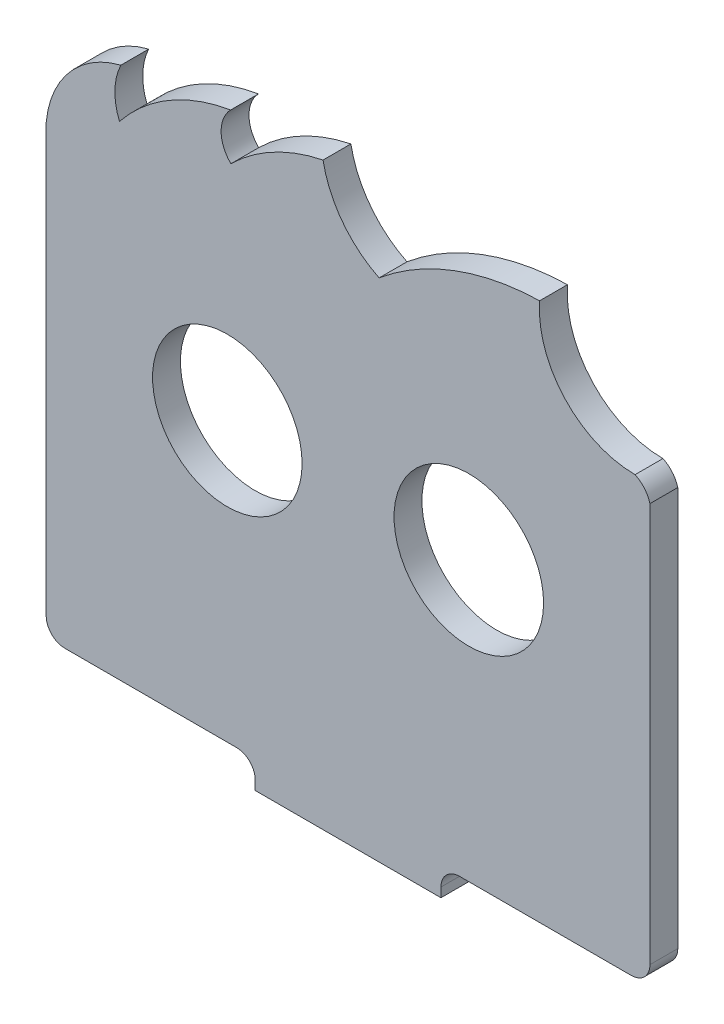
ISO-10303-21;
HEADER;
FILE_DESCRIPTION(('STEP AP214'),'2;1');
FILE_NAME('part.step','',(''),(''),'','','');
FILE_SCHEMA(('AUTOMOTIVE_DESIGN { 1 0 10303 214 1 1 1 1 }'));
ENDSEC;
DATA;
#1=APPLICATION_CONTEXT('core data for automotive mechanical design processes');
#2=APPLICATION_PROTOCOL_DEFINITION('international standard','automotive_design',2000,#1);
#3=PRODUCT_CONTEXT('',#1,'mechanical');
#4=PRODUCT('Part','Part','',(#3));
#5=PRODUCT_RELATED_PRODUCT_CATEGORY('part','',(#4));
#6=PRODUCT_DEFINITION_FORMATION('','',#4);
#7=PRODUCT_DEFINITION_CONTEXT('part definition',#1,'design');
#8=PRODUCT_DEFINITION('design','',#6,#7);
#9=PRODUCT_DEFINITION_SHAPE('','',#8);
#10=(LENGTH_UNIT() NAMED_UNIT(*) SI_UNIT(.MILLI.,.METRE.));
#11=(NAMED_UNIT(*) PLANE_ANGLE_UNIT() SI_UNIT($,.RADIAN.));
#12=(NAMED_UNIT(*) SI_UNIT($,.STERADIAN.) SOLID_ANGLE_UNIT());
#13=UNCERTAINTY_MEASURE_WITH_UNIT(LENGTH_MEASURE(1.E-05),#10,'distance_accuracy_value','');
#14=(GEOMETRIC_REPRESENTATION_CONTEXT(3) GLOBAL_UNCERTAINTY_ASSIGNED_CONTEXT((#13)) GLOBAL_UNIT_ASSIGNED_CONTEXT((#10,
#11,#12)) REPRESENTATION_CONTEXT('',''));
#15=CARTESIAN_POINT('',(0.,0.,0.));
#16=DIRECTION('',(0.,0.,1.));
#17=DIRECTION('',(1.,0.,0.));
#18=AXIS2_PLACEMENT_3D('',#15,#16,#17);
#19=CARTESIAN_POINT('',(-26.9388382551842,-8.04563346128009,-3.5));
#20=DIRECTION('',(0.,1.,0.));
#21=DIRECTION('',(0.,0.,1.));
#22=AXIS2_PLACEMENT_3D('',#19,#20,#21);
#23=CYLINDRICAL_SURFACE('',#22,1.5);
#24=CARTESIAN_POINT('',(-26.9388382551842,-8.04563346128009,-3.5));
#25=DIRECTION('',(0.,1.,0.));
#26=DIRECTION('',(0.,0.,-1.));
#27=AXIS2_PLACEMENT_3D('',#24,#25,#26);
#28=CIRCLE('',#27,1.5);
#29=CARTESIAN_POINT('',(-26.9388382551842,-8.04563346128009,-5.));
#30=VERTEX_POINT('',#29);
#31=EDGE_CURVE('E338',#30,#30,#28,.T.);
#32=ORIENTED_EDGE('',*,*,#31,.F.);
#33=EDGE_LOOP('',(#32));
#34=FACE_BOUND('',#33,.T.);
#35=CARTESIAN_POINT('',(-26.9388382551842,-6.04563346128009,-3.5));
#36=DIRECTION('',(0.,1.,0.));
#37=DIRECTION('',(0.,0.,1.));
#38=AXIS2_PLACEMENT_3D('',#35,#36,#37);
#39=CIRCLE('',#38,1.5);
#40=CARTESIAN_POINT('',(-26.9388382551842,-6.04563346128009,-2.));
#41=VERTEX_POINT('',#40);
#42=EDGE_CURVE('E37',#41,#41,#39,.F.);
#43=ORIENTED_EDGE('',*,*,#42,.F.);
#44=EDGE_LOOP('',(#43));
#45=FACE_BOUND('',#44,.T.);
#46=ADVANCED_FACE('F33',(#34,#45),#23,.F.);
#47=CARTESIAN_POINT('',(-14.9388382551842,-8.04563346128009,-3.5));
#48=DIRECTION('',(0.,1.,0.));
#49=DIRECTION('',(0.,0.,1.));
#50=AXIS2_PLACEMENT_3D('',#47,#48,#49);
#51=CYLINDRICAL_SURFACE('',#50,1.5);
#52=CARTESIAN_POINT('',(-14.9388382551842,-8.04563346128009,-3.5));
#53=DIRECTION('',(0.,1.,0.));
#54=DIRECTION('',(0.,0.,1.));
#55=AXIS2_PLACEMENT_3D('',#52,#53,#54);
#56=CIRCLE('',#55,1.5);
#57=CARTESIAN_POINT('',(-14.9388382551842,-8.04563346128009,-2.));
#58=VERTEX_POINT('',#57);
#59=EDGE_CURVE('E353',#58,#58,#56,.T.);
#60=ORIENTED_EDGE('',*,*,#59,.F.);
#61=EDGE_LOOP('',(#60));
#62=FACE_BOUND('',#61,.T.);
#63=CARTESIAN_POINT('',(-14.9388382551842,-6.04563346128009,-3.5));
#64=DIRECTION('',(0.,1.,0.));
#65=DIRECTION('',(0.,0.,1.));
#66=AXIS2_PLACEMENT_3D('',#63,#64,#65);
#67=CIRCLE('',#66,1.5);
#68=CARTESIAN_POINT('',(-14.9388382551842,-6.04563346128009,-2.));
#69=VERTEX_POINT('',#68);
#70=EDGE_CURVE('E332',#69,#69,#67,.F.);
#71=ORIENTED_EDGE('',*,*,#70,.F.);
#72=EDGE_LOOP('',(#71));
#73=FACE_BOUND('',#72,.T.);
#74=ADVANCED_FACE('F520',(#62,#73),#51,.F.);
#75=CARTESIAN_POINT('',(-32.9388382551842,-7.04419571135436,3.));
#76=DIRECTION('',(0.,0.,1.));
#77=DIRECTION('',(1.,0.,0.));
#78=AXIS2_PLACEMENT_3D('',#75,#76,#77);
#79=PLANE('',#78);
#80=CARTESIAN_POINT('',(-32.9388382551842,-7.04419571135436,3.));
#81=DIRECTION('',(0.,0.,-1.));
#82=DIRECTION('',(1.,0.,0.));
#83=AXIS2_PLACEMENT_3D('',#80,#81,#82);
#84=CIRCLE('',#83,2.);
#85=CARTESIAN_POINT('',(-32.9373999884774,-5.04419622850721,3.));
#86=VERTEX_POINT('',#85);
#87=CARTESIAN_POINT('',(-30.9388382551842,-7.04419571135437,3.));
#88=VERTEX_POINT('',#87);
#89=EDGE_CURVE('E264',#86,#88,#84,.T.);
#90=ORIENTED_EDGE('',*,*,#89,.T.);
#91=DIRECTION('',(0.,-1.,0.));
#92=VECTOR('',#91,1.);
#93=CARTESIAN_POINT('',(-30.9388382551842,-8.04563346128009,3.));
#94=LINE('',#93,#92);
#95=CARTESIAN_POINT('',(-30.9388382551842,-8.04563346128009,3.));
#96=VERTEX_POINT('',#95);
#97=EDGE_CURVE('E379',#88,#96,#94,.T.);
#98=ORIENTED_EDGE('',*,*,#97,.T.);
#99=DIRECTION('',(1.,0.,0.));
#100=VECTOR('',#99,1.);
#101=CARTESIAN_POINT('',(-30.9388382551842,-8.04563346128009,3.));
#102=LINE('',#101,#100);
#103=CARTESIAN_POINT('',(-10.9388382551842,-8.04563346128008,3.));
#104=VERTEX_POINT('',#103);
#105=EDGE_CURVE('E381',#96,#104,#102,.T.);
#106=ORIENTED_EDGE('',*,*,#105,.T.);
#107=DIRECTION('',(0.,1.,0.));
#108=VECTOR('',#107,1.);
#109=CARTESIAN_POINT('',(-10.9388382551842,-8.04563346128008,3.));
#110=LINE('',#109,#108);
#111=CARTESIAN_POINT('',(-10.9388382551842,-7.04563346128011,3.));
#112=VERTEX_POINT('',#111);
#113=EDGE_CURVE('E383',#104,#112,#110,.T.);
#114=ORIENTED_EDGE('',*,*,#113,.T.);
#115=CARTESIAN_POINT('',(-8.9388382551842,-7.04563346128009,3.));
#116=DIRECTION('',(0.,0.,-1.));
#117=DIRECTION('',(-1.,0.,0.));
#118=AXIS2_PLACEMENT_3D('',#115,#116,#117);
#119=CIRCLE('',#118,2.);
#120=CARTESIAN_POINT('',(-8.93883825518419,-5.04563346128009,3.));
#121=VERTEX_POINT('',#120);
#122=EDGE_CURVE('E219',#112,#121,#119,.T.);
#123=ORIENTED_EDGE('',*,*,#122,.T.);
#124=DIRECTION('',(1.,0.,0.));
#125=VECTOR('',#124,1.);
#126=CARTESIAN_POINT('',(9.54977879721579,-5.04563346128009,3.));
#127=LINE('',#126,#125);
#128=CARTESIAN_POINT('',(9.54977879721579,-5.04563346128009,3.));
#129=VERTEX_POINT('',#128);
#130=EDGE_CURVE('E386',#121,#129,#127,.T.);
#131=ORIENTED_EDGE('',*,*,#130,.T.);
#132=CARTESIAN_POINT('',(9.54977879715963,-3.03425009342392,3.));
#133=DIRECTION('',(0.,0.,1.));
#134=DIRECTION('',(1.,0.,0.));
#135=AXIS2_PLACEMENT_3D('',#132,#133,#134);
#136=CIRCLE('',#135,2.01138336785617);
#137=CARTESIAN_POINT('',(11.5611621650158,-3.03425009338009,3.));
#138=VERTEX_POINT('',#137);
#139=EDGE_CURVE('E388',#129,#138,#136,.T.);
#140=ORIENTED_EDGE('',*,*,#139,.T.);
#141=DIRECTION('',(0.,1.,0.));
#142=VECTOR('',#141,1.);
#143=CARTESIAN_POINT('',(11.5611621650158,-3.03425009338009,3.));
#144=LINE('',#143,#142);
#145=CARTESIAN_POINT('',(11.5611621650158,39.9543665387199,3.));
#146=VERTEX_POINT('',#145);
#147=EDGE_CURVE('E390',#138,#146,#144,.T.);
#148=ORIENTED_EDGE('',*,*,#147,.T.);
#149=CARTESIAN_POINT('',(8.6711571271316,39.1494622706601,3.));
#150=DIRECTION('',(0.,0.,1.));
#151=DIRECTION('',(1.,0.,0.));
#152=AXIS2_PLACEMENT_3D('',#149,#150,#151);
#153=CIRCLE('',#152,2.99999999995616);
#154=CARTESIAN_POINT('',(9.96326877626826,41.8569421848796,3.));
#155=VERTEX_POINT('',#154);
#156=EDGE_CURVE('E392',#146,#155,#153,.T.);
#157=ORIENTED_EDGE('',*,*,#156,.T.);
#158=CARTESIAN_POINT('',(9.96327365671662,52.164706248931,3.));
#159=DIRECTION('',(0.,0.,-1.));
#160=DIRECTION('',(1.,0.,0.));
#161=AXIS2_PLACEMENT_3D('',#158,#159,#160);
#162=CIRCLE('',#161,10.3077640640525);
#163=CARTESIAN_POINT('',(-0.316073105073237,52.9295788860759,3.));
#164=VERTEX_POINT('',#163);
#165=EDGE_CURVE('E394',#155,#164,#162,.T.);
#166=ORIENTED_EDGE('',*,*,#165,.T.);
#167=CARTESIAN_POINT('',(0.334070879254689,25.0061800654525,3.));
#168=DIRECTION('',(0.,0.,1.));
#169=DIRECTION('',(1.,0.,0.));
#170=AXIS2_PLACEMENT_3D('',#167,#168,#169);
#171=CIRCLE('',#170,27.9309664869649);
#172=CARTESIAN_POINT('',(-17.5966330199045,46.4217992854664,3.));
#173=VERTEX_POINT('',#172);
#174=EDGE_CURVE('E396',#164,#173,#171,.T.);
#175=ORIENTED_EDGE('',*,*,#174,.T.);
#176=CARTESIAN_POINT('',(-12.6427939069682,56.4447468580342,3.));
#177=DIRECTION('',(0.,0.,-1.));
#178=DIRECTION('',(1.,0.,0.));
#179=AXIS2_PLACEMENT_3D('',#176,#177,#178);
#180=CIRCLE('',#179,11.1803398874677);
#181=CARTESIAN_POINT('',(-23.6334554327833,54.3940496048375,3.));
#182=VERTEX_POINT('',#181);
#183=EDGE_CURVE('E398',#173,#182,#180,.T.);
#184=ORIENTED_EDGE('',*,*,#183,.T.);
#185=CARTESIAN_POINT('',(-19.6409106266977,34.9994260531066,3.));
#186=DIRECTION('',(0.,0.,1.));
#187=DIRECTION('',(1.,0.,0.));
#188=AXIS2_PLACEMENT_3D('',#185,#186,#187);
#189=CIRCLE('',#188,19.8013089653679);
#190=CARTESIAN_POINT('',(-33.5590096383543,49.0841112339575,3.));
#191=VERTEX_POINT('',#190);
#192=EDGE_CURVE('E400',#182,#191,#189,.T.);
#193=ORIENTED_EDGE('',*,*,#192,.T.);
#194=CARTESIAN_POINT('',(-31.0705631471978,51.5956115945062,3.));
#195=DIRECTION('',(0.,0.,-1.));
#196=DIRECTION('',(1.,0.,0.));
#197=AXIS2_PLACEMENT_3D('',#194,#195,#196);
#198=CIRCLE('',#197,3.53553390598723);
#199=CARTESIAN_POINT('',(-33.5820635077474,54.0840580856617,3.));
#200=VERTEX_POINT('',#199);
#201=EDGE_CURVE('E402',#191,#200,#198,.T.);
#202=ORIENTED_EDGE('',*,*,#201,.T.);
#203=CARTESIAN_POINT('',(-30.3940306785091,34.9985545114886,3.));
#204=DIRECTION('',(0.,0.,1.));
#205=DIRECTION('',(1.,0.,0.));
#206=AXIS2_PLACEMENT_3D('',#203,#204,#205);
#207=CIRCLE('',#206,19.349935400411);
#208=CARTESIAN_POINT('',(-45.5496605344325,47.0288032067699,3.));
#209=VERTEX_POINT('',#208);
#210=EDGE_CURVE('E404',#200,#209,#207,.T.);
#211=ORIENTED_EDGE('',*,*,#210,.T.);
#212=CARTESIAN_POINT('',(-39.5276442918751,49.5258655556389,3.));
#213=DIRECTION('',(0.,0.,-1.));
#214=DIRECTION('',(1.,0.,0.));
#215=AXIS2_PLACEMENT_3D('',#212,#213,#214);
#216=CIRCLE('',#215,6.51920240518462);
#217=CARTESIAN_POINT('',(-45.4026362473856,52.351545920162,3.));
#218=VERTEX_POINT('',#217);
#219=EDGE_CURVE('E406',#209,#218,#216,.T.);
#220=ORIENTED_EDGE('',*,*,#219,.T.);
#221=CARTESIAN_POINT('',(-42.8405498499119,42.0197772486442,3.));
#222=DIRECTION('',(0.,0.,1.));
#223=DIRECTION('',(1.,0.,0.));
#224=AXIS2_PLACEMENT_3D('',#221,#222,#223);
#225=CIRCLE('',#224,10.6447043448786);
#226=CARTESIAN_POINT('',(-53.4388382551842,43.0127593575199,3.));
#227=VERTEX_POINT('',#226);
#228=EDGE_CURVE('E408',#218,#227,#225,.T.);
#229=ORIENTED_EDGE('',*,*,#228,.T.);
#230=DIRECTION('',(0.,-1.,0.));
#231=VECTOR('',#230,1.);
#232=CARTESIAN_POINT('',(-53.4388382551842,43.0127593575199,3.));
#233=LINE('',#232,#231);
#234=CARTESIAN_POINT('',(-53.4388382551842,-2.98832438728009,3.));
#235=VERTEX_POINT('',#234);
#236=EDGE_CURVE('E410',#227,#235,#233,.T.);
#237=ORIENTED_EDGE('',*,*,#236,.T.);
#238=CARTESIAN_POINT('',(-51.4276967484391,-3.01951560936317,3.));
#239=DIRECTION('',(0.,0.,1.));
#240=DIRECTION('',(1.,0.,0.));
#241=AXIS2_PLACEMENT_3D('',#238,#239,#240);
#242=CIRCLE('',#241,2.01138336785609);
#243=CARTESIAN_POINT('',(-51.4301685763842,-5.03089745838009,3.));
#244=VERTEX_POINT('',#243);
#245=EDGE_CURVE('E412',#235,#244,#242,.T.);
#246=ORIENTED_EDGE('',*,*,#245,.T.);
#247=DIRECTION('',(0.999999741423577,-0.000719133353405182,0.));
#248=VECTOR('',#247,1.);
#249=CARTESIAN_POINT('',(-32.9373999884774,-5.04419622850721,3.));
#250=LINE('',#249,#248);
#251=EDGE_CURVE('E269',#244,#86,#250,.T.);
#252=ORIENTED_EDGE('',*,*,#251,.T.);
#253=EDGE_LOOP('',(#90,#98,#106,#114,#123,#131,#140,#148,#157,#166,#175,#184,#193,#202,#211,
#220,#229,#237,#246,#252));
#254=FACE_BOUND('',#253,.T.);
#255=CARTESIAN_POINT('',(-7.93883825518421,24.9543665387199,3.));
#256=DIRECTION('',(0.,0.,1.));
#257=DIRECTION('',(1.,0.,0.));
#258=AXIS2_PLACEMENT_3D('',#255,#256,#257);
#259=CIRCLE('',#258,8.05000000000001);
#260=CARTESIAN_POINT('',(0.111161744815805,24.9543665387199,3.));
#261=VERTEX_POINT('',#260);
#262=EDGE_CURVE('E233',#261,#261,#259,.T.);
#263=ORIENTED_EDGE('',*,*,#262,.F.);
#264=EDGE_LOOP('',(#263));
#265=FACE_BOUND('',#264,.T.);
#266=CARTESIAN_POINT('',(-33.9388382551842,24.9543665387199,3.));
#267=DIRECTION('',(0.,0.,1.));
#268=DIRECTION('',(1.,0.,0.));
#269=AXIS2_PLACEMENT_3D('',#266,#267,#268);
#270=CIRCLE('',#269,8.05);
#271=CARTESIAN_POINT('',(-25.8888382551842,24.9543665387199,3.));
#272=VERTEX_POINT('',#271);
#273=EDGE_CURVE('E367',#272,#272,#270,.T.);
#274=ORIENTED_EDGE('',*,*,#273,.F.);
#275=EDGE_LOOP('',(#274));
#276=FACE_BOUND('',#275,.T.);
#277=ADVANCED_FACE('F416',(#254,#265,#276),#79,.T.);
#278=CARTESIAN_POINT('',(-32.9388382551842,-7.04419571135436,0.));
#279=DIRECTION('',(0.,0.,1.));
#280=DIRECTION('',(1.,0.,0.));
#281=AXIS2_PLACEMENT_3D('',#278,#279,#280);
#282=PLANE('',#281);
#283=DIRECTION('',(-1.,0.,0.));
#284=VECTOR('',#283,1.);
#285=CARTESIAN_POINT('',(-32.9388382551842,-5.04563346128009,0.));
#286=LINE('',#285,#284);
#287=CARTESIAN_POINT('',(-10.9388382551842,-5.04563346128009,0.));
#288=VERTEX_POINT('',#287);
#289=CARTESIAN_POINT('',(-30.9388382551842,-5.04563346128009,0.));
#290=VERTEX_POINT('',#289);
#291=EDGE_CURVE('E319',#288,#290,#286,.T.);
#292=ORIENTED_EDGE('',*,*,#291,.T.);
#293=DIRECTION('',(0.,-1.,0.));
#294=VECTOR('',#293,1.);
#295=CARTESIAN_POINT('',(-30.9388382551842,-7.04419571135436,0.));
#296=LINE('',#295,#294);
#297=CARTESIAN_POINT('',(-30.9388382551842,-7.04419571135436,0.));
#298=VERTEX_POINT('',#297);
#299=EDGE_CURVE('E211',#290,#298,#296,.T.);
#300=ORIENTED_EDGE('',*,*,#299,.T.);
#301=CARTESIAN_POINT('',(-32.9388382551842,-7.04419571135436,0.));
#302=DIRECTION('',(0.,0.,-1.));
#303=DIRECTION('',(1.,0.,0.));
#304=AXIS2_PLACEMENT_3D('',#301,#302,#303);
#305=CIRCLE('',#304,2.);
#306=CARTESIAN_POINT('',(-32.9373999884774,-5.04419622850721,0.));
#307=VERTEX_POINT('',#306);
#308=EDGE_CURVE('E228',#307,#298,#305,.T.);
#309=ORIENTED_EDGE('',*,*,#308,.F.);
#310=DIRECTION('',(0.999999741423577,-0.000719133353405182,0.));
#311=VECTOR('',#310,1.);
#312=CARTESIAN_POINT('',(-32.9373999884774,-5.04419622850721,0.));
#313=LINE('',#312,#311);
#314=CARTESIAN_POINT('',(-51.4301685763842,-5.03089745838009,0.));
#315=VERTEX_POINT('',#314);
#316=EDGE_CURVE('E262',#315,#307,#313,.T.);
#317=ORIENTED_EDGE('',*,*,#316,.F.);
#318=CARTESIAN_POINT('',(-51.4276967484391,-3.01951560936317,0.));
#319=DIRECTION('',(0.,0.,1.));
#320=DIRECTION('',(1.,0.,0.));
#321=AXIS2_PLACEMENT_3D('',#318,#319,#320);
#322=CIRCLE('',#321,2.01138336785609);
#323=CARTESIAN_POINT('',(-53.4388382551842,-2.98832438728009,0.));
#324=VERTEX_POINT('',#323);
#325=EDGE_CURVE('E260',#324,#315,#322,.T.);
#326=ORIENTED_EDGE('',*,*,#325,.F.);
#327=DIRECTION('',(0.,-1.,0.));
#328=VECTOR('',#327,1.);
#329=CARTESIAN_POINT('',(-53.4388382551842,43.0127593575199,0.));
#330=LINE('',#329,#328);
#331=CARTESIAN_POINT('',(-53.4388382551842,43.0127593575199,0.));
#332=VERTEX_POINT('',#331);
#333=EDGE_CURVE('E258',#332,#324,#330,.T.);
#334=ORIENTED_EDGE('',*,*,#333,.F.);
#335=CARTESIAN_POINT('',(-42.8405498499119,42.0197772486442,0.));
#336=DIRECTION('',(0.,0.,1.));
#337=DIRECTION('',(1.,0.,0.));
#338=AXIS2_PLACEMENT_3D('',#335,#336,#337);
#339=CIRCLE('',#338,10.6447043448786);
#340=CARTESIAN_POINT('',(-45.4026362473856,52.351545920162,0.));
#341=VERTEX_POINT('',#340);
#342=EDGE_CURVE('E256',#341,#332,#339,.T.);
#343=ORIENTED_EDGE('',*,*,#342,.F.);
#344=CARTESIAN_POINT('',(-39.5276442918751,49.5258655556389,0.));
#345=DIRECTION('',(0.,0.,-1.));
#346=DIRECTION('',(1.,0.,0.));
#347=AXIS2_PLACEMENT_3D('',#344,#345,#346);
#348=CIRCLE('',#347,6.51920240518462);
#349=CARTESIAN_POINT('',(-45.5496605344325,47.0288032067699,0.));
#350=VERTEX_POINT('',#349);
#351=EDGE_CURVE('E254',#350,#341,#348,.T.);
#352=ORIENTED_EDGE('',*,*,#351,.F.);
#353=CARTESIAN_POINT('',(-30.3940306785091,34.9985545114886,0.));
#354=DIRECTION('',(0.,0.,1.));
#355=DIRECTION('',(1.,0.,0.));
#356=AXIS2_PLACEMENT_3D('',#353,#354,#355);
#357=CIRCLE('',#356,19.349935400411);
#358=CARTESIAN_POINT('',(-33.5820635077474,54.0840580856617,0.));
#359=VERTEX_POINT('',#358);
#360=EDGE_CURVE('E252',#359,#350,#357,.T.);
#361=ORIENTED_EDGE('',*,*,#360,.F.);
#362=CARTESIAN_POINT('',(-31.0705631471978,51.5956115945062,0.));
#363=DIRECTION('',(0.,0.,-1.));
#364=DIRECTION('',(1.,0.,0.));
#365=AXIS2_PLACEMENT_3D('',#362,#363,#364);
#366=CIRCLE('',#365,3.53553390598723);
#367=CARTESIAN_POINT('',(-33.5590096383543,49.0841112339575,0.));
#368=VERTEX_POINT('',#367);
#369=EDGE_CURVE('E250',#368,#359,#366,.T.);
#370=ORIENTED_EDGE('',*,*,#369,.F.);
#371=CARTESIAN_POINT('',(-19.6409106266977,34.9994260531066,0.));
#372=DIRECTION('',(0.,0.,1.));
#373=DIRECTION('',(1.,0.,0.));
#374=AXIS2_PLACEMENT_3D('',#371,#372,#373);
#375=CIRCLE('',#374,19.8013089653679);
#376=CARTESIAN_POINT('',(-23.6334554327833,54.3940496048375,0.));
#377=VERTEX_POINT('',#376);
#378=EDGE_CURVE('E248',#377,#368,#375,.T.);
#379=ORIENTED_EDGE('',*,*,#378,.F.);
#380=CARTESIAN_POINT('',(-12.6427939069682,56.4447468580342,0.));
#381=DIRECTION('',(0.,0.,-1.));
#382=DIRECTION('',(1.,0.,0.));
#383=AXIS2_PLACEMENT_3D('',#380,#381,#382);
#384=CIRCLE('',#383,11.1803398874677);
#385=CARTESIAN_POINT('',(-17.5966330199045,46.4217992854664,0.));
#386=VERTEX_POINT('',#385);
#387=EDGE_CURVE('E246',#386,#377,#384,.T.);
#388=ORIENTED_EDGE('',*,*,#387,.F.);
#389=CARTESIAN_POINT('',(0.334070879254689,25.0061800654525,0.));
#390=DIRECTION('',(0.,0.,1.));
#391=DIRECTION('',(1.,0.,0.));
#392=AXIS2_PLACEMENT_3D('',#389,#390,#391);
#393=CIRCLE('',#392,27.9309664869649);
#394=CARTESIAN_POINT('',(-0.316073105073237,52.9295788860759,0.));
#395=VERTEX_POINT('',#394);
#396=EDGE_CURVE('E244',#395,#386,#393,.T.);
#397=ORIENTED_EDGE('',*,*,#396,.F.);
#398=CARTESIAN_POINT('',(9.96327365671662,52.164706248931,0.));
#399=DIRECTION('',(0.,0.,-1.));
#400=DIRECTION('',(1.,0.,0.));
#401=AXIS2_PLACEMENT_3D('',#398,#399,#400);
#402=CIRCLE('',#401,10.3077640640525);
#403=CARTESIAN_POINT('',(9.96326877626826,41.8569421848796,0.));
#404=VERTEX_POINT('',#403);
#405=EDGE_CURVE('E242',#404,#395,#402,.T.);
#406=ORIENTED_EDGE('',*,*,#405,.F.);
#407=CARTESIAN_POINT('',(8.6711571271316,39.1494622706601,0.));
#408=DIRECTION('',(0.,0.,1.));
#409=DIRECTION('',(1.,0.,0.));
#410=AXIS2_PLACEMENT_3D('',#407,#408,#409);
#411=CIRCLE('',#410,2.99999999995616);
#412=CARTESIAN_POINT('',(11.5611621650158,39.9543665387199,0.));
#413=VERTEX_POINT('',#412);
#414=EDGE_CURVE('E240',#413,#404,#411,.T.);
#415=ORIENTED_EDGE('',*,*,#414,.F.);
#416=DIRECTION('',(0.,1.,0.));
#417=VECTOR('',#416,1.);
#418=CARTESIAN_POINT('',(11.5611621650158,-3.03425009338009,0.));
#419=LINE('',#418,#417);
#420=CARTESIAN_POINT('',(11.5611621650158,-3.03425009338009,0.));
#421=VERTEX_POINT('',#420);
#422=EDGE_CURVE('E238',#421,#413,#419,.T.);
#423=ORIENTED_EDGE('',*,*,#422,.F.);
#424=CARTESIAN_POINT('',(9.54977879715963,-3.03425009342392,0.));
#425=DIRECTION('',(0.,0.,1.));
#426=DIRECTION('',(1.,0.,0.));
#427=AXIS2_PLACEMENT_3D('',#424,#425,#426);
#428=CIRCLE('',#427,2.01138336785617);
#429=CARTESIAN_POINT('',(9.54977879721579,-5.04563346128009,0.));
#430=VERTEX_POINT('',#429);
#431=EDGE_CURVE('E230',#430,#421,#428,.T.);
#432=ORIENTED_EDGE('',*,*,#431,.F.);
#433=DIRECTION('',(1.,0.,0.));
#434=VECTOR('',#433,1.);
#435=CARTESIAN_POINT('',(9.54977879721579,-5.04563346128009,0.));
#436=LINE('',#435,#434);
#437=CARTESIAN_POINT('',(-8.93883825518419,-5.04563346128009,0.));
#438=VERTEX_POINT('',#437);
#439=EDGE_CURVE('E227',#438,#430,#436,.T.);
#440=ORIENTED_EDGE('',*,*,#439,.F.);
#441=CARTESIAN_POINT('',(-8.9388382551842,-7.04563346128009,0.));
#442=DIRECTION('',(0.,0.,-1.));
#443=DIRECTION('',(-1.,0.,0.));
#444=AXIS2_PLACEMENT_3D('',#441,#442,#443);
#445=CIRCLE('',#444,2.);
#446=CARTESIAN_POINT('',(-10.9388382551842,-7.04563346128009,0.));
#447=VERTEX_POINT('',#446);
#448=EDGE_CURVE('E217',#447,#438,#445,.T.);
#449=ORIENTED_EDGE('',*,*,#448,.F.);
#450=DIRECTION('',(0.,1.,0.));
#451=VECTOR('',#450,1.);
#452=CARTESIAN_POINT('',(-10.9388382551842,-7.04419571135436,0.));
#453=LINE('',#452,#451);
#454=EDGE_CURVE('E198',#447,#288,#453,.T.);
#455=ORIENTED_EDGE('',*,*,#454,.T.);
#456=EDGE_LOOP('',(#292,#300,#309,#317,#326,#334,#343,#352,#361,#370,#379,#388,#397,#406,#415,
#423,#432,#440,#449,#455));
#457=FACE_BOUND('',#456,.T.);
#458=CARTESIAN_POINT('',(-7.93883825518421,24.9543665387199,0.));
#459=DIRECTION('',(0.,0.,1.));
#460=DIRECTION('',(1.,0.,0.));
#461=AXIS2_PLACEMENT_3D('',#458,#459,#460);
#462=CIRCLE('',#461,8.05000000000001);
#463=CARTESIAN_POINT('',(0.111161744815805,24.9543665387199,0.));
#464=VERTEX_POINT('',#463);
#465=EDGE_CURVE('E370',#464,#464,#462,.T.);
#466=ORIENTED_EDGE('',*,*,#465,.T.);
#467=EDGE_LOOP('',(#466));
#468=FACE_BOUND('',#467,.T.);
#469=CARTESIAN_POINT('',(-33.9388382551842,24.9543665387199,0.));
#470=DIRECTION('',(0.,0.,1.));
#471=DIRECTION('',(1.,0.,0.));
#472=AXIS2_PLACEMENT_3D('',#469,#470,#471);
#473=CIRCLE('',#472,8.05);
#474=CARTESIAN_POINT('',(-25.8888382551842,24.9543665387199,0.));
#475=VERTEX_POINT('',#474);
#476=EDGE_CURVE('E366',#475,#475,#473,.T.);
#477=ORIENTED_EDGE('',*,*,#476,.T.);
#478=EDGE_LOOP('',(#477));
#479=FACE_BOUND('',#478,.T.);
#480=ADVANCED_FACE('F224',(#457,#468,#479),#282,.F.);
#481=CARTESIAN_POINT('',(-32.9388382551842,-7.04419571135436,3.));
#482=DIRECTION('',(0.,0.,-1.));
#483=DIRECTION('',(-1.,0.,0.));
#484=AXIS2_PLACEMENT_3D('',#481,#482,#483);
#485=CYLINDRICAL_SURFACE('',#484,2.);
#486=ORIENTED_EDGE('',*,*,#308,.T.);
#487=DIRECTION('',(0.,0.,-1.));
#488=VECTOR('',#487,1.);
#489=CARTESIAN_POINT('',(-30.9388382551842,-7.04419571135437,3.));
#490=LINE('',#489,#488);
#491=EDGE_CURVE('E316',#88,#298,#490,.T.);
#492=ORIENTED_EDGE('',*,*,#491,.F.);
#493=ORIENTED_EDGE('',*,*,#89,.F.);
#494=DIRECTION('',(0.,0.,-1.));
#495=VECTOR('',#494,1.);
#496=CARTESIAN_POINT('',(-32.9373999884774,-5.04419622850721,3.));
#497=LINE('',#496,#495);
#498=EDGE_CURVE('E265',#86,#307,#497,.T.);
#499=ORIENTED_EDGE('',*,*,#498,.T.);
#500=EDGE_LOOP('',(#486,#492,#493,#499));
#501=FACE_BOUND('',#500,.T.);
#502=ADVANCED_FACE('F427',(#501),#485,.F.);
#503=CARTESIAN_POINT('',(-30.9388382551842,-8.04563346128009,3.));
#504=DIRECTION('',(1.,0.,0.));
#505=DIRECTION('',(0.,0.,-1.));
#506=AXIS2_PLACEMENT_3D('',#503,#504,#505);
#507=PLANE('',#506);
#508=DIRECTION('',(0.,0.,1.));
#509=VECTOR('',#508,1.);
#510=CARTESIAN_POINT('',(-30.9388382551842,-5.04563346128009,-8.));
#511=LINE('',#510,#509);
#512=CARTESIAN_POINT('',(-30.9388382551842,-5.04563346128009,-6.));
#513=VERTEX_POINT('',#512);
#514=EDGE_CURVE('E212',#513,#290,#511,.T.);
#515=ORIENTED_EDGE('',*,*,#514,.F.);
#516=DIRECTION('',(0.,-1.,0.));
#517=VECTOR('',#516,1.);
#518=CARTESIAN_POINT('',(-30.9388382551842,-8.04563346128009,-6.));
#519=LINE('',#518,#517);
#520=CARTESIAN_POINT('',(-30.9388382551842,-8.04563346128009,-6.));
#521=VERTEX_POINT('',#520);
#522=EDGE_CURVE('E321',#513,#521,#519,.T.);
#523=ORIENTED_EDGE('',*,*,#522,.T.);
#524=DIRECTION('',(0.,0.,-1.));
#525=VECTOR('',#524,1.);
#526=CARTESIAN_POINT('',(-30.9388382551842,-8.04563346128009,3.));
#527=LINE('',#526,#525);
#528=EDGE_CURVE('E313',#96,#521,#527,.T.);
#529=ORIENTED_EDGE('',*,*,#528,.F.);
#530=ORIENTED_EDGE('',*,*,#97,.F.);
#531=ORIENTED_EDGE('',*,*,#491,.T.);
#532=ORIENTED_EDGE('',*,*,#299,.F.);
#533=EDGE_LOOP('',(#515,#523,#529,#530,#531,#532));
#534=FACE_BOUND('',#533,.T.);
#535=ADVANCED_FACE('F431',(#534),#507,.F.);
#536=CARTESIAN_POINT('',(-30.9388382551842,-8.04563346128009,3.));
#537=DIRECTION('',(0.,1.,0.));
#538=DIRECTION('',(-1.,0.,0.));
#539=AXIS2_PLACEMENT_3D('',#536,#537,#538);
#540=PLANE('',#539);
#541=ORIENTED_EDGE('',*,*,#59,.T.);
#542=EDGE_LOOP('',(#541));
#543=FACE_BOUND('',#542,.T.);
#544=ORIENTED_EDGE('',*,*,#31,.T.);
#545=EDGE_LOOP('',(#544));
#546=FACE_BOUND('',#545,.T.);
#547=ORIENTED_EDGE('',*,*,#528,.T.);
#548=CARTESIAN_POINT('',(-28.9388382551842,-8.04563346128009,-6.));
#549=DIRECTION('',(0.,1.,0.));
#550=DIRECTION('',(-1.,0.,0.));
#551=AXIS2_PLACEMENT_3D('',#548,#549,#550);
#552=CIRCLE('',#551,2.);
#553=CARTESIAN_POINT('',(-28.9388382551842,-8.04563346128009,-8.));
#554=VERTEX_POINT('',#553);
#555=EDGE_CURVE('E326',#521,#554,#552,.F.);
#556=ORIENTED_EDGE('',*,*,#555,.T.);
#557=DIRECTION('',(1.,0.,0.));
#558=VECTOR('',#557,1.);
#559=CARTESIAN_POINT('',(-10.9388382551842,-8.04563346128009,-8.));
#560=LINE('',#559,#558);
#561=CARTESIAN_POINT('',(-12.9388382551842,-8.04563346128009,-8.));
#562=VERTEX_POINT('',#561);
#563=EDGE_CURVE('E356',#554,#562,#560,.T.);
#564=ORIENTED_EDGE('',*,*,#563,.T.);
#565=CARTESIAN_POINT('',(-12.9388382551842,-8.04563346128008,-6.));
#566=DIRECTION('',(0.,1.,0.));
#567=DIRECTION('',(-1.,0.,0.));
#568=AXIS2_PLACEMENT_3D('',#565,#566,#567);
#569=CIRCLE('',#568,2.);
#570=CARTESIAN_POINT('',(-10.9388382551842,-8.04563346128008,-6.));
#571=VERTEX_POINT('',#570);
#572=EDGE_CURVE('E324',#562,#571,#569,.F.);
#573=ORIENTED_EDGE('',*,*,#572,.T.);
#574=DIRECTION('',(0.,0.,-1.));
#575=VECTOR('',#574,1.);
#576=CARTESIAN_POINT('',(-10.9388382551842,-8.04563346128008,3.));
#577=LINE('',#576,#575);
#578=EDGE_CURVE('E220',#104,#571,#577,.T.);
#579=ORIENTED_EDGE('',*,*,#578,.F.);
#580=ORIENTED_EDGE('',*,*,#105,.F.);
#581=EDGE_LOOP('',(#547,#556,#564,#573,#579,#580));
#582=FACE_BOUND('',#581,.T.);
#583=ADVANCED_FACE('F436',(#543,#546,#582),#540,.F.);
#584=CARTESIAN_POINT('',(-10.9388382551842,-8.04563346128008,3.));
#585=DIRECTION('',(-1.,0.,0.));
#586=DIRECTION('',(0.,0.,1.));
#587=AXIS2_PLACEMENT_3D('',#584,#585,#586);
#588=PLANE('',#587);
#589=ORIENTED_EDGE('',*,*,#578,.T.);
#590=DIRECTION('',(0.,1.,0.));
#591=VECTOR('',#590,1.);
#592=CARTESIAN_POINT('',(-10.9388382551842,-5.04563346128009,-6.));
#593=LINE('',#592,#591);
#594=CARTESIAN_POINT('',(-10.9388382551842,-5.04563346128009,-6.));
#595=VERTEX_POINT('',#594);
#596=EDGE_CURVE('E11',#571,#595,#593,.T.);
#597=ORIENTED_EDGE('',*,*,#596,.T.);
#598=DIRECTION('',(0.,0.,1.));
#599=VECTOR('',#598,1.);
#600=CARTESIAN_POINT('',(-10.9388382551842,-5.04563346128009,-8.));
#601=LINE('',#600,#599);
#602=EDGE_CURVE('E206',#595,#288,#601,.T.);
#603=ORIENTED_EDGE('',*,*,#602,.T.);
#604=ORIENTED_EDGE('',*,*,#454,.F.);
#605=DIRECTION('',(0.,0.,-1.));
#606=VECTOR('',#605,1.);
#607=CARTESIAN_POINT('',(-10.9388382551842,-7.04563346128011,3.));
#608=LINE('',#607,#606);
#609=EDGE_CURVE('E203',#112,#447,#608,.T.);
#610=ORIENTED_EDGE('',*,*,#609,.F.);
#611=ORIENTED_EDGE('',*,*,#113,.F.);
#612=EDGE_LOOP('',(#589,#597,#603,#604,#610,#611));
#613=FACE_BOUND('',#612,.T.);
#614=ADVANCED_FACE('F201',(#613),#588,.F.);
#615=CARTESIAN_POINT('',(-8.9388382551842,-7.04563346128009,3.));
#616=DIRECTION('',(0.,0.,-1.));
#617=DIRECTION('',(-1.,0.,0.));
#618=AXIS2_PLACEMENT_3D('',#615,#616,#617);
#619=CYLINDRICAL_SURFACE('',#618,2.);
#620=ORIENTED_EDGE('',*,*,#448,.T.);
#621=DIRECTION('',(0.,0.,-1.));
#622=VECTOR('',#621,1.);
#623=CARTESIAN_POINT('',(-8.93883825518419,-5.04563346128009,3.));
#624=LINE('',#623,#622);
#625=EDGE_CURVE('E221',#121,#438,#624,.T.);
#626=ORIENTED_EDGE('',*,*,#625,.F.);
#627=ORIENTED_EDGE('',*,*,#122,.F.);
#628=ORIENTED_EDGE('',*,*,#609,.T.);
#629=EDGE_LOOP('',(#620,#626,#627,#628));
#630=FACE_BOUND('',#629,.T.);
#631=ADVANCED_FACE('F215',(#630),#619,.F.);
#632=CARTESIAN_POINT('',(9.54977879721579,-5.04563346128009,3.));
#633=DIRECTION('',(0.,1.,0.));
#634=DIRECTION('',(0.,0.,1.));
#635=AXIS2_PLACEMENT_3D('',#632,#633,#634);
#636=PLANE('',#635);
#637=ORIENTED_EDGE('',*,*,#439,.T.);
#638=DIRECTION('',(0.,0.,-1.));
#639=VECTOR('',#638,1.);
#640=CARTESIAN_POINT('',(9.54977879721579,-5.04563346128009,3.));
#641=LINE('',#640,#639);
#642=EDGE_CURVE('E308',#129,#430,#641,.T.);
#643=ORIENTED_EDGE('',*,*,#642,.F.);
#644=ORIENTED_EDGE('',*,*,#130,.F.);
#645=ORIENTED_EDGE('',*,*,#625,.T.);
#646=EDGE_LOOP('',(#637,#643,#644,#645));
#647=FACE_BOUND('',#646,.T.);
#648=ADVANCED_FACE('F510',(#647),#636,.F.);
#649=CARTESIAN_POINT('',(9.54977879715963,-3.03425009342392,3.));
#650=DIRECTION('',(0.,0.,-1.));
#651=DIRECTION('',(-1.,0.,0.));
#652=AXIS2_PLACEMENT_3D('',#649,#650,#651);
#653=CYLINDRICAL_SURFACE('',#652,2.01138336785617);
#654=ORIENTED_EDGE('',*,*,#431,.T.);
#655=DIRECTION('',(0.,0.,-1.));
#656=VECTOR('',#655,1.);
#657=CARTESIAN_POINT('',(11.5611621650158,-3.03425009338009,3.));
#658=LINE('',#657,#656);
#659=EDGE_CURVE('E305',#138,#421,#658,.T.);
#660=ORIENTED_EDGE('',*,*,#659,.F.);
#661=ORIENTED_EDGE('',*,*,#139,.F.);
#662=ORIENTED_EDGE('',*,*,#642,.T.);
#663=EDGE_LOOP('',(#654,#660,#661,#662));
#664=FACE_BOUND('',#663,.T.);
#665=ADVANCED_FACE('F505',(#664),#653,.T.);
#666=CARTESIAN_POINT('',(11.5611621650158,-3.03425009338009,3.));
#667=DIRECTION('',(-1.,0.,0.));
#668=DIRECTION('',(0.,0.,1.));
#669=AXIS2_PLACEMENT_3D('',#666,#667,#668);
#670=PLANE('',#669);
#671=ORIENTED_EDGE('',*,*,#422,.T.);
#672=DIRECTION('',(0.,0.,-1.));
#673=VECTOR('',#672,1.);
#674=CARTESIAN_POINT('',(11.5611621650158,39.9543665387199,3.));
#675=LINE('',#674,#673);
#676=EDGE_CURVE('E302',#146,#413,#675,.T.);
#677=ORIENTED_EDGE('',*,*,#676,.F.);
#678=ORIENTED_EDGE('',*,*,#147,.F.);
#679=ORIENTED_EDGE('',*,*,#659,.T.);
#680=EDGE_LOOP('',(#671,#677,#678,#679));
#681=FACE_BOUND('',#680,.T.);
#682=ADVANCED_FACE('F502',(#681),#670,.F.);
#683=CARTESIAN_POINT('',(8.6711571271316,39.1494622706601,3.));
#684=DIRECTION('',(0.,0.,-1.));
#685=DIRECTION('',(-1.,0.,0.));
#686=AXIS2_PLACEMENT_3D('',#683,#684,#685);
#687=CYLINDRICAL_SURFACE('',#686,2.99999999995616);
#688=ORIENTED_EDGE('',*,*,#414,.T.);
#689=DIRECTION('',(0.,0.,-1.));
#690=VECTOR('',#689,1.);
#691=CARTESIAN_POINT('',(9.96326877626826,41.8569421848796,3.));
#692=LINE('',#691,#690);
#693=EDGE_CURVE('E299',#155,#404,#692,.T.);
#694=ORIENTED_EDGE('',*,*,#693,.F.);
#695=ORIENTED_EDGE('',*,*,#156,.F.);
#696=ORIENTED_EDGE('',*,*,#676,.T.);
#697=EDGE_LOOP('',(#688,#694,#695,#696));
#698=FACE_BOUND('',#697,.T.);
#699=ADVANCED_FACE('F498',(#698),#687,.T.);
#700=CARTESIAN_POINT('',(9.96327365671662,52.164706248931,3.));
#701=DIRECTION('',(0.,0.,-1.));
#702=DIRECTION('',(-1.,0.,0.));
#703=AXIS2_PLACEMENT_3D('',#700,#701,#702);
#704=CYLINDRICAL_SURFACE('',#703,10.3077640640525);
#705=ORIENTED_EDGE('',*,*,#405,.T.);
#706=DIRECTION('',(0.,0.,-1.));
#707=VECTOR('',#706,1.);
#708=CARTESIAN_POINT('',(-0.316073105073237,52.9295788860759,3.));
#709=LINE('',#708,#707);
#710=EDGE_CURVE('E296',#164,#395,#709,.T.);
#711=ORIENTED_EDGE('',*,*,#710,.F.);
#712=ORIENTED_EDGE('',*,*,#165,.F.);
#713=ORIENTED_EDGE('',*,*,#693,.T.);
#714=EDGE_LOOP('',(#705,#711,#712,#713));
#715=FACE_BOUND('',#714,.T.);
#716=ADVANCED_FACE('F493',(#715),#704,.F.);
#717=CARTESIAN_POINT('',(0.334070879254689,25.0061800654525,3.));
#718=DIRECTION('',(0.,0.,-1.));
#719=DIRECTION('',(-1.,0.,0.));
#720=AXIS2_PLACEMENT_3D('',#717,#718,#719);
#721=CYLINDRICAL_SURFACE('',#720,27.9309664869649);
#722=ORIENTED_EDGE('',*,*,#396,.T.);
#723=DIRECTION('',(0.,0.,-1.));
#724=VECTOR('',#723,1.);
#725=CARTESIAN_POINT('',(-17.5966330199045,46.4217992854664,3.));
#726=LINE('',#725,#724);
#727=EDGE_CURVE('E293',#173,#386,#726,.T.);
#728=ORIENTED_EDGE('',*,*,#727,.F.);
#729=ORIENTED_EDGE('',*,*,#174,.F.);
#730=ORIENTED_EDGE('',*,*,#710,.T.);
#731=EDGE_LOOP('',(#722,#728,#729,#730));
#732=FACE_BOUND('',#731,.T.);
#733=ADVANCED_FACE('F487',(#732),#721,.T.);
#734=CARTESIAN_POINT('',(-12.6427939069682,56.4447468580342,3.));
#735=DIRECTION('',(0.,0.,-1.));
#736=DIRECTION('',(-1.,0.,0.));
#737=AXIS2_PLACEMENT_3D('',#734,#735,#736);
#738=CYLINDRICAL_SURFACE('',#737,11.1803398874677);
#739=ORIENTED_EDGE('',*,*,#387,.T.);
#740=DIRECTION('',(0.,0.,-1.));
#741=VECTOR('',#740,1.);
#742=CARTESIAN_POINT('',(-23.6334554327833,54.3940496048375,3.));
#743=LINE('',#742,#741);
#744=EDGE_CURVE('E290',#182,#377,#743,.T.);
#745=ORIENTED_EDGE('',*,*,#744,.F.);
#746=ORIENTED_EDGE('',*,*,#183,.F.);
#747=ORIENTED_EDGE('',*,*,#727,.T.);
#748=EDGE_LOOP('',(#739,#745,#746,#747));
#749=FACE_BOUND('',#748,.T.);
#750=ADVANCED_FACE('F483',(#749),#738,.F.);
#751=CARTESIAN_POINT('',(-19.6409106266977,34.9994260531066,3.));
#752=DIRECTION('',(0.,0.,-1.));
#753=DIRECTION('',(-1.,0.,0.));
#754=AXIS2_PLACEMENT_3D('',#751,#752,#753);
#755=CYLINDRICAL_SURFACE('',#754,19.8013089653679);
#756=ORIENTED_EDGE('',*,*,#378,.T.);
#757=DIRECTION('',(0.,0.,-1.));
#758=VECTOR('',#757,1.);
#759=CARTESIAN_POINT('',(-33.5590096383543,49.0841112339575,3.));
#760=LINE('',#759,#758);
#761=EDGE_CURVE('E287',#191,#368,#760,.T.);
#762=ORIENTED_EDGE('',*,*,#761,.F.);
#763=ORIENTED_EDGE('',*,*,#192,.F.);
#764=ORIENTED_EDGE('',*,*,#744,.T.);
#765=EDGE_LOOP('',(#756,#762,#763,#764));
#766=FACE_BOUND('',#765,.T.);
#767=ADVANCED_FACE('F478',(#766),#755,.T.);
#768=CARTESIAN_POINT('',(-31.0705631471978,51.5956115945062,3.));
#769=DIRECTION('',(0.,0.,-1.));
#770=DIRECTION('',(-1.,0.,0.));
#771=AXIS2_PLACEMENT_3D('',#768,#769,#770);
#772=CYLINDRICAL_SURFACE('',#771,3.53553390598723);
#773=ORIENTED_EDGE('',*,*,#369,.T.);
#774=DIRECTION('',(0.,0.,-1.));
#775=VECTOR('',#774,1.);
#776=CARTESIAN_POINT('',(-33.5820635077474,54.0840580856617,3.));
#777=LINE('',#776,#775);
#778=EDGE_CURVE('E284',#200,#359,#777,.T.);
#779=ORIENTED_EDGE('',*,*,#778,.F.);
#780=ORIENTED_EDGE('',*,*,#201,.F.);
#781=ORIENTED_EDGE('',*,*,#761,.T.);
#782=EDGE_LOOP('',(#773,#779,#780,#781));
#783=FACE_BOUND('',#782,.T.);
#784=ADVANCED_FACE('F472',(#783),#772,.F.);
#785=CARTESIAN_POINT('',(-30.3940306785091,34.9985545114886,3.));
#786=DIRECTION('',(0.,0.,-1.));
#787=DIRECTION('',(-1.,0.,0.));
#788=AXIS2_PLACEMENT_3D('',#785,#786,#787);
#789=CYLINDRICAL_SURFACE('',#788,19.349935400411);
#790=ORIENTED_EDGE('',*,*,#360,.T.);
#791=DIRECTION('',(0.,0.,-1.));
#792=VECTOR('',#791,1.);
#793=CARTESIAN_POINT('',(-45.5496605344325,47.0288032067699,3.));
#794=LINE('',#793,#792);
#795=EDGE_CURVE('E281',#209,#350,#794,.T.);
#796=ORIENTED_EDGE('',*,*,#795,.F.);
#797=ORIENTED_EDGE('',*,*,#210,.F.);
#798=ORIENTED_EDGE('',*,*,#778,.T.);
#799=EDGE_LOOP('',(#790,#796,#797,#798));
#800=FACE_BOUND('',#799,.T.);
#801=ADVANCED_FACE('F468',(#800),#789,.T.);
#802=CARTESIAN_POINT('',(-39.5276442918751,49.5258655556389,3.));
#803=DIRECTION('',(0.,0.,-1.));
#804=DIRECTION('',(-1.,0.,0.));
#805=AXIS2_PLACEMENT_3D('',#802,#803,#804);
#806=CYLINDRICAL_SURFACE('',#805,6.51920240518462);
#807=ORIENTED_EDGE('',*,*,#351,.T.);
#808=DIRECTION('',(0.,0.,-1.));
#809=VECTOR('',#808,1.);
#810=CARTESIAN_POINT('',(-45.4026362473856,52.351545920162,3.));
#811=LINE('',#810,#809);
#812=EDGE_CURVE('E278',#218,#341,#811,.T.);
#813=ORIENTED_EDGE('',*,*,#812,.F.);
#814=ORIENTED_EDGE('',*,*,#219,.F.);
#815=ORIENTED_EDGE('',*,*,#795,.T.);
#816=EDGE_LOOP('',(#807,#813,#814,#815));
#817=FACE_BOUND('',#816,.T.);
#818=ADVANCED_FACE('F463',(#817),#806,.F.);
#819=CARTESIAN_POINT('',(-42.8405498499119,42.0197772486442,3.));
#820=DIRECTION('',(0.,0.,-1.));
#821=DIRECTION('',(-1.,0.,0.));
#822=AXIS2_PLACEMENT_3D('',#819,#820,#821);
#823=CYLINDRICAL_SURFACE('',#822,10.6447043448786);
#824=ORIENTED_EDGE('',*,*,#342,.T.);
#825=DIRECTION('',(0.,0.,-1.));
#826=VECTOR('',#825,1.);
#827=CARTESIAN_POINT('',(-53.4388382551842,43.0127593575199,3.));
#828=LINE('',#827,#826);
#829=EDGE_CURVE('E275',#227,#332,#828,.T.);
#830=ORIENTED_EDGE('',*,*,#829,.F.);
#831=ORIENTED_EDGE('',*,*,#228,.F.);
#832=ORIENTED_EDGE('',*,*,#812,.T.);
#833=EDGE_LOOP('',(#824,#830,#831,#832));
#834=FACE_BOUND('',#833,.T.);
#835=ADVANCED_FACE('F457',(#834),#823,.T.);
#836=CARTESIAN_POINT('',(-53.4388382551842,43.0127593575199,3.));
#837=DIRECTION('',(1.,0.,0.));
#838=DIRECTION('',(0.,0.,-1.));
#839=AXIS2_PLACEMENT_3D('',#836,#837,#838);
#840=PLANE('',#839);
#841=ORIENTED_EDGE('',*,*,#333,.T.);
#842=DIRECTION('',(0.,0.,-1.));
#843=VECTOR('',#842,1.);
#844=CARTESIAN_POINT('',(-53.4388382551842,-2.98832438728009,3.));
#845=LINE('',#844,#843);
#846=EDGE_CURVE('E272',#235,#324,#845,.T.);
#847=ORIENTED_EDGE('',*,*,#846,.F.);
#848=ORIENTED_EDGE('',*,*,#236,.F.);
#849=ORIENTED_EDGE('',*,*,#829,.T.);
#850=EDGE_LOOP('',(#841,#847,#848,#849));
#851=FACE_BOUND('',#850,.T.);
#852=ADVANCED_FACE('F453',(#851),#840,.F.);
#853=CARTESIAN_POINT('',(-51.4276967484391,-3.01951560936317,3.));
#854=DIRECTION('',(0.,0.,-1.));
#855=DIRECTION('',(-1.,0.,0.));
#856=AXIS2_PLACEMENT_3D('',#853,#854,#855);
#857=CYLINDRICAL_SURFACE('',#856,2.01138336785609);
#858=ORIENTED_EDGE('',*,*,#325,.T.);
#859=DIRECTION('',(0.,0.,-1.));
#860=VECTOR('',#859,1.);
#861=CARTESIAN_POINT('',(-51.4301685763842,-5.03089745838009,3.));
#862=LINE('',#861,#860);
#863=EDGE_CURVE('E268',#244,#315,#862,.T.);
#864=ORIENTED_EDGE('',*,*,#863,.F.);
#865=ORIENTED_EDGE('',*,*,#245,.F.);
#866=ORIENTED_EDGE('',*,*,#846,.T.);
#867=EDGE_LOOP('',(#858,#864,#865,#866));
#868=FACE_BOUND('',#867,.T.);
#869=ADVANCED_FACE('F449',(#868),#857,.T.);
#870=CARTESIAN_POINT('',(-32.9373999884774,-5.04419622850721,3.));
#871=DIRECTION('',(0.000719133353405182,0.999999741423577,0.));
#872=DIRECTION('',(-0.999999741423577,0.000719133353405182,0.));
#873=AXIS2_PLACEMENT_3D('',#870,#871,#872);
#874=PLANE('',#873);
#875=ORIENTED_EDGE('',*,*,#316,.T.);
#876=ORIENTED_EDGE('',*,*,#498,.F.);
#877=ORIENTED_EDGE('',*,*,#251,.F.);
#878=ORIENTED_EDGE('',*,*,#863,.T.);
#879=EDGE_LOOP('',(#875,#876,#877,#878));
#880=FACE_BOUND('',#879,.T.);
#881=ADVANCED_FACE('F423',(#880),#874,.F.);
#882=CARTESIAN_POINT('',(-7.93883825518421,24.9543665387199,3.));
#883=DIRECTION('',(0.,0.,-1.));
#884=DIRECTION('',(-1.,0.,0.));
#885=AXIS2_PLACEMENT_3D('',#882,#883,#884);
#886=CYLINDRICAL_SURFACE('',#885,8.05000000000001);
#887=ORIENTED_EDGE('',*,*,#262,.T.);
#888=EDGE_LOOP('',(#887));
#889=FACE_BOUND('',#888,.T.);
#890=ORIENTED_EDGE('',*,*,#465,.F.);
#891=EDGE_LOOP('',(#890));
#892=FACE_BOUND('',#891,.T.);
#893=ADVANCED_FACE('F541',(#889,#892),#886,.F.);
#894=CARTESIAN_POINT('',(-33.9388382551842,24.9543665387199,3.));
#895=DIRECTION('',(0.,0.,-1.));
#896=DIRECTION('',(-1.,0.,0.));
#897=AXIS2_PLACEMENT_3D('',#894,#895,#896);
#898=CYLINDRICAL_SURFACE('',#897,8.05);
#899=ORIENTED_EDGE('',*,*,#273,.T.);
#900=EDGE_LOOP('',(#899));
#901=FACE_BOUND('',#900,.T.);
#902=ORIENTED_EDGE('',*,*,#476,.F.);
#903=EDGE_LOOP('',(#902));
#904=FACE_BOUND('',#903,.T.);
#905=ADVANCED_FACE('F537',(#901,#904),#898,.F.);
#906=CARTESIAN_POINT('',(-30.9388382551842,-5.04563346128009,-8.));
#907=DIRECTION('',(0.,1.,0.));
#908=DIRECTION('',(0.,0.,1.));
#909=AXIS2_PLACEMENT_3D('',#906,#907,#908);
#910=PLANE('',#909);
#911=CARTESIAN_POINT('',(-26.9388382551842,-5.04563346128009,-3.5));
#912=DIRECTION('',(0.,1.,0.));
#913=DIRECTION('',(0.,0.,1.));
#914=AXIS2_PLACEMENT_3D('',#911,#912,#913);
#915=CIRCLE('',#914,2.25);
#916=CARTESIAN_POINT('',(-26.9388382551842,-5.04563346128009,-1.25));
#917=VERTEX_POINT('',#916);
#918=EDGE_CURVE('E340',#917,#917,#915,.T.);
#919=ORIENTED_EDGE('',*,*,#918,.F.);
#920=EDGE_LOOP('',(#919));
#921=FACE_BOUND('',#920,.T.);
#922=CARTESIAN_POINT('',(-14.9388382551842,-5.04563346128009,-3.5));
#923=DIRECTION('',(0.,1.,0.));
#924=DIRECTION('',(0.,0.,1.));
#925=AXIS2_PLACEMENT_3D('',#922,#923,#924);
#926=CIRCLE('',#925,2.25);
#927=CARTESIAN_POINT('',(-14.9388382551842,-5.04563346128009,-1.25));
#928=VERTEX_POINT('',#927);
#929=EDGE_CURVE('E350',#928,#928,#926,.T.);
#930=ORIENTED_EDGE('',*,*,#929,.F.);
#931=EDGE_LOOP('',(#930));
#932=FACE_BOUND('',#931,.T.);
#933=DIRECTION('',(-1.,0.,0.));
#934=VECTOR('',#933,1.);
#935=CARTESIAN_POINT('',(-30.9388382551842,-5.04563346128009,-8.));
#936=LINE('',#935,#934);
#937=CARTESIAN_POINT('',(-12.9388382551842,-5.04563346128009,-8.));
#938=VERTEX_POINT('',#937);
#939=CARTESIAN_POINT('',(-28.9388382551842,-5.04563346128009,-8.));
#940=VERTEX_POINT('',#939);
#941=EDGE_CURVE('E361',#938,#940,#936,.T.);
#942=ORIENTED_EDGE('',*,*,#941,.T.);
#943=CARTESIAN_POINT('',(-28.9388382551842,-5.04563346128009,-6.));
#944=DIRECTION('',(0.,1.,0.));
#945=DIRECTION('',(0.,0.,1.));
#946=AXIS2_PLACEMENT_3D('',#943,#944,#945);
#947=CIRCLE('',#946,2.);
#948=EDGE_CURVE('E42',#940,#513,#947,.T.);
#949=ORIENTED_EDGE('',*,*,#948,.T.);
#950=ORIENTED_EDGE('',*,*,#514,.T.);
#951=ORIENTED_EDGE('',*,*,#291,.F.);
#952=ORIENTED_EDGE('',*,*,#602,.F.);
#953=CARTESIAN_POINT('',(-12.9388382551842,-5.04563346128009,-6.));
#954=DIRECTION('',(0.,1.,0.));
#955=DIRECTION('',(0.,0.,1.));
#956=AXIS2_PLACEMENT_3D('',#953,#954,#955);
#957=CIRCLE('',#956,2.);
#958=EDGE_CURVE('E50',#595,#938,#957,.T.);
#959=ORIENTED_EDGE('',*,*,#958,.T.);
#960=EDGE_LOOP('',(#942,#949,#950,#951,#952,#959));
#961=FACE_BOUND('',#960,.T.);
#962=ADVANCED_FACE('F444',(#921,#932,#961),#910,.T.);
#963=CARTESIAN_POINT('',(0.,0.,-8.));
#964=DIRECTION('',(0.,0.,-1.));
#965=DIRECTION('',(-1.,0.,0.));
#966=AXIS2_PLACEMENT_3D('',#963,#964,#965);
#967=PLANE('',#966);
#968=ORIENTED_EDGE('',*,*,#563,.F.);
#969=DIRECTION('',(0.,-1.,0.));
#970=VECTOR('',#969,1.);
#971=CARTESIAN_POINT('',(-28.9388382551842,-5.04563346128009,-8.));
#972=LINE('',#971,#970);
#973=EDGE_CURVE('E57',#554,#940,#972,.F.);
#974=ORIENTED_EDGE('',*,*,#973,.T.);
#975=ORIENTED_EDGE('',*,*,#941,.F.);
#976=DIRECTION('',(0.,1.,0.));
#977=VECTOR('',#976,1.);
#978=CARTESIAN_POINT('',(-12.9388382551842,-8.04563346128009,-8.));
#979=LINE('',#978,#977);
#980=EDGE_CURVE('E328',#938,#562,#979,.F.);
#981=ORIENTED_EDGE('',*,*,#980,.T.);
#982=EDGE_LOOP('',(#968,#974,#975,#981));
#983=FACE_BOUND('',#982,.T.);
#984=ADVANCED_FACE('F438',(#983),#967,.T.);
#985=CARTESIAN_POINT('',(-28.9388382551842,-8.04563346128009,-6.));
#986=DIRECTION('',(0.,1.,0.));
#987=DIRECTION('',(0.,0.,1.));
#988=AXIS2_PLACEMENT_3D('',#985,#986,#987);
#989=CYLINDRICAL_SURFACE('',#988,2.);
#990=ORIENTED_EDGE('',*,*,#948,.F.);
#991=ORIENTED_EDGE('',*,*,#973,.F.);
#992=ORIENTED_EDGE('',*,*,#555,.F.);
#993=ORIENTED_EDGE('',*,*,#522,.F.);
#994=EDGE_LOOP('',(#990,#991,#992,#993));
#995=FACE_BOUND('',#994,.T.);
#996=ADVANCED_FACE('F442',(#995),#989,.T.);
#997=CARTESIAN_POINT('',(-12.9388382551842,-8.04563346128008,-6.));
#998=DIRECTION('',(0.,-1.,0.));
#999=DIRECTION('',(0.,0.,-1.));
#1000=AXIS2_PLACEMENT_3D('',#997,#998,#999);
#1001=CYLINDRICAL_SURFACE('',#1000,2.);
#1002=ORIENTED_EDGE('',*,*,#572,.F.);
#1003=ORIENTED_EDGE('',*,*,#980,.F.);
#1004=ORIENTED_EDGE('',*,*,#958,.F.);
#1005=ORIENTED_EDGE('',*,*,#596,.F.);
#1006=EDGE_LOOP('',(#1002,#1003,#1004,#1005));
#1007=FACE_BOUND('',#1006,.T.);
#1008=ADVANCED_FACE('F35',(#1007),#1001,.T.);
#1009=CARTESIAN_POINT('',(-14.9388382551842,-6.04563346128009,-3.5));
#1010=DIRECTION('',(0.,1.,0.));
#1011=DIRECTION('',(0.,0.,1.));
#1012=AXIS2_PLACEMENT_3D('',#1009,#1010,#1011);
#1013=PLANE('',#1012);
#1014=CARTESIAN_POINT('',(-14.9388382551842,-6.04563346128009,-3.5));
#1015=DIRECTION('',(0.,1.,0.));
#1016=DIRECTION('',(0.,0.,1.));
#1017=AXIS2_PLACEMENT_3D('',#1014,#1015,#1016);
#1018=CIRCLE('',#1017,2.25);
#1019=CARTESIAN_POINT('',(-14.9388382551842,-6.04563346128009,-1.25));
#1020=VERTEX_POINT('',#1019);
#1021=EDGE_CURVE('E345',#1020,#1020,#1018,.T.);
#1022=ORIENTED_EDGE('',*,*,#1021,.T.);
#1023=EDGE_LOOP('',(#1022));
#1024=FACE_BOUND('',#1023,.T.);
#1025=ORIENTED_EDGE('',*,*,#70,.T.);
#1026=EDGE_LOOP('',(#1025));
#1027=FACE_BOUND('',#1026,.T.);
#1028=ADVANCED_FACE('F659',(#1024,#1027),#1013,.T.);
#1029=CARTESIAN_POINT('',(-14.9388382551842,-6.04563346128009,-3.5));
#1030=DIRECTION('',(0.,1.,0.));
#1031=DIRECTION('',(0.,0.,1.));
#1032=AXIS2_PLACEMENT_3D('',#1029,#1030,#1031);
#1033=CYLINDRICAL_SURFACE('',#1032,2.25);
#1034=ORIENTED_EDGE('',*,*,#1021,.F.);
#1035=EDGE_LOOP('',(#1034));
#1036=FACE_BOUND('',#1035,.T.);
#1037=ORIENTED_EDGE('',*,*,#929,.T.);
#1038=EDGE_LOOP('',(#1037));
#1039=FACE_BOUND('',#1038,.T.);
#1040=ADVANCED_FACE('F674',(#1036,#1039),#1033,.F.);
#1041=CARTESIAN_POINT('',(-26.9388382551842,-6.04563346128009,-3.5));
#1042=DIRECTION('',(0.,1.,0.));
#1043=DIRECTION('',(0.,0.,1.));
#1044=AXIS2_PLACEMENT_3D('',#1041,#1042,#1043);
#1045=PLANE('',#1044);
#1046=CARTESIAN_POINT('',(-26.9388382551842,-6.04563346128009,-3.5));
#1047=DIRECTION('',(0.,1.,0.));
#1048=DIRECTION('',(0.,0.,1.));
#1049=AXIS2_PLACEMENT_3D('',#1046,#1047,#1048);
#1050=CIRCLE('',#1049,2.25);
#1051=CARTESIAN_POINT('',(-26.9388382551842,-6.04563346128009,-1.25));
#1052=VERTEX_POINT('',#1051);
#1053=EDGE_CURVE('E334',#1052,#1052,#1050,.T.);
#1054=ORIENTED_EDGE('',*,*,#1053,.T.);
#1055=EDGE_LOOP('',(#1054));
#1056=FACE_BOUND('',#1055,.T.);
#1057=ORIENTED_EDGE('',*,*,#42,.T.);
#1058=EDGE_LOOP('',(#1057));
#1059=FACE_BOUND('',#1058,.T.);
#1060=ADVANCED_FACE('F681',(#1056,#1059),#1045,.T.);
#1061=CARTESIAN_POINT('',(-26.9388382551842,-6.04563346128009,-3.5));
#1062=DIRECTION('',(0.,1.,0.));
#1063=DIRECTION('',(0.,0.,1.));
#1064=AXIS2_PLACEMENT_3D('',#1061,#1062,#1063);
#1065=CYLINDRICAL_SURFACE('',#1064,2.25);
#1066=ORIENTED_EDGE('',*,*,#1053,.F.);
#1067=EDGE_LOOP('',(#1066));
#1068=FACE_BOUND('',#1067,.T.);
#1069=ORIENTED_EDGE('',*,*,#918,.T.);
#1070=EDGE_LOOP('',(#1069));
#1071=FACE_BOUND('',#1070,.T.);
#1072=ADVANCED_FACE('F688',(#1068,#1071),#1065,.F.);
#1073=CLOSED_SHELL('',(#46,#74,#277,#480,#502,#535,#583,#614,#631,#648,#665,#682,#699,#716,#733,
#750,#767,#784,#801,#818,#835,#852,#869,#881,#893,#905,#962,#984,#996,#1008,#1028,#1040,#1060,#1072));
#1074=MANIFOLD_SOLID_BREP('B2',#1073);
#1075=ADVANCED_BREP_SHAPE_REPRESENTATION('',(#18,#1074),#14);
#1076=SHAPE_DEFINITION_REPRESENTATION(#9,#1075);
ENDSEC;
END-ISO-10303-21;
